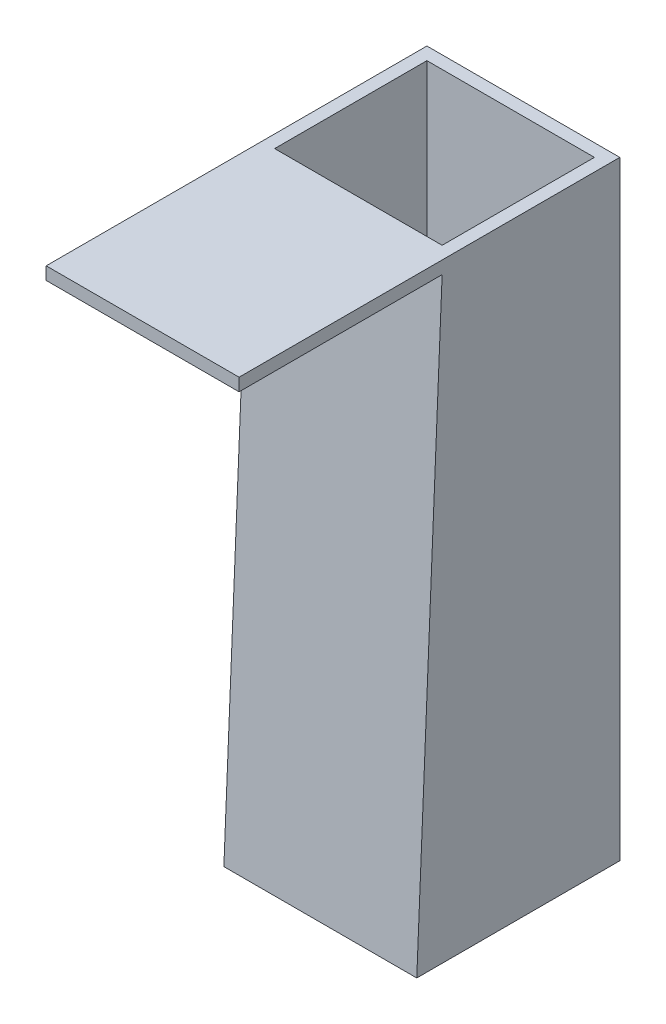
ISO-10303-21;
HEADER;
FILE_DESCRIPTION(('STEP AP214'),'2;1');
FILE_NAME('part.step','',(''),(''),'','','');
FILE_SCHEMA(('AUTOMOTIVE_DESIGN { 1 0 10303 214 1 1 1 1 }'));
ENDSEC;
DATA;
#1=APPLICATION_CONTEXT('core data for automotive mechanical design processes');
#2=APPLICATION_PROTOCOL_DEFINITION('international standard','automotive_design',2000,#1);
#3=PRODUCT_CONTEXT('',#1,'mechanical');
#4=PRODUCT('Part','Part','',(#3));
#5=PRODUCT_RELATED_PRODUCT_CATEGORY('part','',(#4));
#6=PRODUCT_DEFINITION_FORMATION('','',#4);
#7=PRODUCT_DEFINITION_CONTEXT('part definition',#1,'design');
#8=PRODUCT_DEFINITION('design','',#6,#7);
#9=PRODUCT_DEFINITION_SHAPE('','',#8);
#10=(LENGTH_UNIT() NAMED_UNIT(*) SI_UNIT(.MILLI.,.METRE.));
#11=(NAMED_UNIT(*) PLANE_ANGLE_UNIT() SI_UNIT($,.RADIAN.));
#12=(NAMED_UNIT(*) SI_UNIT($,.STERADIAN.) SOLID_ANGLE_UNIT());
#13=UNCERTAINTY_MEASURE_WITH_UNIT(LENGTH_MEASURE(1.E-05),#10,'distance_accuracy_value','');
#14=(GEOMETRIC_REPRESENTATION_CONTEXT(3) GLOBAL_UNCERTAINTY_ASSIGNED_CONTEXT((#13)) GLOBAL_UNIT_ASSIGNED_CONTEXT((#10,
#11,#12)) REPRESENTATION_CONTEXT('',''));
#15=CARTESIAN_POINT('',(0.,0.,0.));
#16=DIRECTION('',(0.,0.,1.));
#17=DIRECTION('',(1.,0.,0.));
#18=AXIS2_PLACEMENT_3D('',#15,#16,#17);
#19=CARTESIAN_POINT('',(96.52,0.,0.));
#20=DIRECTION('',(0.,0.0425147166248136,0.999095840683121));
#21=DIRECTION('',(0.,-0.999095840683121,0.0425147166248136));
#22=AXIS2_PLACEMENT_3D('',#19,#20,#21);
#23=PLANE('',#22);
#24=DIRECTION('',(0.,0.999095840683121,-0.0425147166248136));
#25=VECTOR('',#24,1.);
#26=CARTESIAN_POINT('',(0.,0.,0.));
#27=LINE('',#26,#25);
#28=CARTESIAN_POINT('',(0.,0.,0.));
#29=VERTEX_POINT('',#28);
#30=CARTESIAN_POINT('',(0.,298.45,-12.7));
#31=VERTEX_POINT('',#30);
#32=EDGE_CURVE('E143',#29,#31,#27,.T.);
#33=ORIENTED_EDGE('',*,*,#32,.F.);
#34=DIRECTION('',(-1.,0.,0.));
#35=VECTOR('',#34,1.);
#36=CARTESIAN_POINT('',(96.52,0.,0.));
#37=LINE('',#36,#35);
#38=CARTESIAN_POINT('',(96.52,0.,0.));
#39=VERTEX_POINT('',#38);
#40=EDGE_CURVE('E11',#39,#29,#37,.T.);
#41=ORIENTED_EDGE('',*,*,#40,.F.);
#42=DIRECTION('',(0.,0.999095840683121,-0.0425147166248136));
#43=VECTOR('',#42,1.);
#44=CARTESIAN_POINT('',(96.52,0.,0.));
#45=LINE('',#44,#43);
#46=CARTESIAN_POINT('',(96.52,298.45,-12.7));
#47=VERTEX_POINT('',#46);
#48=EDGE_CURVE('E147',#39,#47,#45,.T.);
#49=ORIENTED_EDGE('',*,*,#48,.T.);
#50=DIRECTION('',(-1.,0.,0.));
#51=VECTOR('',#50,1.);
#52=CARTESIAN_POINT('',(96.52,298.45,-12.7));
#53=LINE('',#52,#51);
#54=EDGE_CURVE('E36',#47,#31,#53,.T.);
#55=ORIENTED_EDGE('',*,*,#54,.T.);
#56=EDGE_LOOP('',(#33,#41,#49,#55));
#57=FACE_BOUND('',#56,.T.);
#58=ADVANCED_FACE('F33',(#57),#23,.T.);
#59=CARTESIAN_POINT('',(96.52,0.,-101.6));
#60=DIRECTION('',(0.,-1.,0.));
#61=DIRECTION('',(0.,0.,-1.));
#62=AXIS2_PLACEMENT_3D('',#59,#60,#61);
#63=PLANE('',#62);
#64=DIRECTION('',(0.,0.,-1.));
#65=VECTOR('',#64,1.);
#66=CARTESIAN_POINT('',(6.35,0.,-95.25));
#67=LINE('',#66,#65);
#68=CARTESIAN_POINT('',(6.35,0.,-19.05));
#69=VERTEX_POINT('',#68);
#70=CARTESIAN_POINT('',(6.34999999999999,0.,-95.25));
#71=VERTEX_POINT('',#70);
#72=EDGE_CURVE('E49',#69,#71,#67,.T.);
#73=ORIENTED_EDGE('',*,*,#72,.F.);
#74=DIRECTION('',(-1.,0.,0.));
#75=VECTOR('',#74,1.);
#76=CARTESIAN_POINT('',(6.35,0.,-19.05));
#77=LINE('',#76,#75);
#78=CARTESIAN_POINT('',(90.17,0.,-19.05));
#79=VERTEX_POINT('',#78);
#80=EDGE_CURVE('E128',#79,#69,#77,.T.);
#81=ORIENTED_EDGE('',*,*,#80,.F.);
#82=DIRECTION('',(0.,0.,1.));
#83=VECTOR('',#82,1.);
#84=CARTESIAN_POINT('',(90.17,0.,-95.25));
#85=LINE('',#84,#83);
#86=CARTESIAN_POINT('',(90.17,0.,-95.25));
#87=VERTEX_POINT('',#86);
#88=EDGE_CURVE('E131',#87,#79,#85,.T.);
#89=ORIENTED_EDGE('',*,*,#88,.F.);
#90=DIRECTION('',(1.,0.,0.));
#91=VECTOR('',#90,1.);
#92=CARTESIAN_POINT('',(6.35,0.,-95.25));
#93=LINE('',#92,#91);
#94=EDGE_CURVE('E137',#71,#87,#93,.T.);
#95=ORIENTED_EDGE('',*,*,#94,.F.);
#96=EDGE_LOOP('',(#73,#81,#89,#95));
#97=FACE_BOUND('',#96,.T.);
#98=DIRECTION('',(0.,0.,1.));
#99=VECTOR('',#98,1.);
#100=CARTESIAN_POINT('',(0.,0.,-101.6));
#101=LINE('',#100,#99);
#102=CARTESIAN_POINT('',(0.,0.,-101.6));
#103=VERTEX_POINT('',#102);
#104=EDGE_CURVE('E151',#103,#29,#101,.T.);
#105=ORIENTED_EDGE('',*,*,#104,.F.);
#106=DIRECTION('',(-1.,0.,0.));
#107=VECTOR('',#106,1.);
#108=CARTESIAN_POINT('',(96.52,0.,-101.6));
#109=LINE('',#108,#107);
#110=CARTESIAN_POINT('',(96.52,0.,-101.6));
#111=VERTEX_POINT('',#110);
#112=EDGE_CURVE('E41',#111,#103,#109,.T.);
#113=ORIENTED_EDGE('',*,*,#112,.F.);
#114=DIRECTION('',(0.,0.,1.));
#115=VECTOR('',#114,1.);
#116=CARTESIAN_POINT('',(96.52,0.,-101.6));
#117=LINE('',#116,#115);
#118=EDGE_CURVE('E163',#111,#39,#117,.T.);
#119=ORIENTED_EDGE('',*,*,#118,.T.);
#120=ORIENTED_EDGE('',*,*,#40,.T.);
#121=EDGE_LOOP('',(#105,#113,#119,#120));
#122=FACE_BOUND('',#121,.T.);
#123=ADVANCED_FACE('F200',(#97,#122),#63,.T.);
#124=CARTESIAN_POINT('',(96.52,304.8,-101.6));
#125=DIRECTION('',(0.,0.,-1.));
#126=DIRECTION('',(0.,1.,0.));
#127=AXIS2_PLACEMENT_3D('',#124,#125,#126);
#128=PLANE('',#127);
#129=DIRECTION('',(0.,-1.,0.));
#130=VECTOR('',#129,1.);
#131=CARTESIAN_POINT('',(0.,304.8,-101.6));
#132=LINE('',#131,#130);
#133=CARTESIAN_POINT('',(0.,304.8,-101.6));
#134=VERTEX_POINT('',#133);
#135=EDGE_CURVE('E177',#134,#103,#132,.T.);
#136=ORIENTED_EDGE('',*,*,#135,.F.);
#137=DIRECTION('',(-1.,0.,0.));
#138=VECTOR('',#137,1.);
#139=CARTESIAN_POINT('',(96.52,304.8,-101.6));
#140=LINE('',#139,#138);
#141=CARTESIAN_POINT('',(96.52,304.8,-101.6));
#142=VERTEX_POINT('',#141);
#143=EDGE_CURVE('E183',#142,#134,#140,.T.);
#144=ORIENTED_EDGE('',*,*,#143,.F.);
#145=DIRECTION('',(0.,-1.,0.));
#146=VECTOR('',#145,1.);
#147=CARTESIAN_POINT('',(96.52,304.8,-101.6));
#148=LINE('',#147,#146);
#149=EDGE_CURVE('E160',#142,#111,#148,.T.);
#150=ORIENTED_EDGE('',*,*,#149,.T.);
#151=ORIENTED_EDGE('',*,*,#112,.T.);
#152=EDGE_LOOP('',(#136,#144,#150,#151));
#153=FACE_BOUND('',#152,.T.);
#154=ADVANCED_FACE('F211',(#153),#128,.T.);
#155=CARTESIAN_POINT('',(96.52,304.8,88.9));
#156=DIRECTION('',(0.,1.,0.));
#157=DIRECTION('',(0.,0.,1.));
#158=AXIS2_PLACEMENT_3D('',#155,#156,#157);
#159=PLANE('',#158);
#160=DIRECTION('',(0.,0.,-1.));
#161=VECTOR('',#160,1.);
#162=CARTESIAN_POINT('',(6.35,304.8,-95.25));
#163=LINE('',#162,#161);
#164=CARTESIAN_POINT('',(6.35,304.8,-19.05));
#165=VERTEX_POINT('',#164);
#166=CARTESIAN_POINT('',(6.35,304.8,-95.25));
#167=VERTEX_POINT('',#166);
#168=EDGE_CURVE('E112',#165,#167,#163,.T.);
#169=ORIENTED_EDGE('',*,*,#168,.T.);
#170=DIRECTION('',(1.,0.,0.));
#171=VECTOR('',#170,1.);
#172=CARTESIAN_POINT('',(6.35,304.8,-95.25));
#173=LINE('',#172,#171);
#174=CARTESIAN_POINT('',(90.17,304.8,-95.25));
#175=VERTEX_POINT('',#174);
#176=EDGE_CURVE('E121',#167,#175,#173,.T.);
#177=ORIENTED_EDGE('',*,*,#176,.T.);
#178=DIRECTION('',(0.,0.,1.));
#179=VECTOR('',#178,1.);
#180=CARTESIAN_POINT('',(90.17,304.8,-95.25));
#181=LINE('',#180,#179);
#182=CARTESIAN_POINT('',(90.17,304.8,-19.05));
#183=VERTEX_POINT('',#182);
#184=EDGE_CURVE('E57',#175,#183,#181,.T.);
#185=ORIENTED_EDGE('',*,*,#184,.T.);
#186=DIRECTION('',(-1.,0.,0.));
#187=VECTOR('',#186,1.);
#188=CARTESIAN_POINT('',(6.35,304.8,-19.05));
#189=LINE('',#188,#187);
#190=EDGE_CURVE('E118',#183,#165,#189,.T.);
#191=ORIENTED_EDGE('',*,*,#190,.T.);
#192=EDGE_LOOP('',(#169,#177,#185,#191));
#193=FACE_BOUND('',#192,.T.);
#194=DIRECTION('',(0.,0.,-1.));
#195=VECTOR('',#194,1.);
#196=CARTESIAN_POINT('',(0.,304.8,88.9));
#197=LINE('',#196,#195);
#198=CARTESIAN_POINT('',(0.,304.8,88.9));
#199=VERTEX_POINT('',#198);
#200=EDGE_CURVE('E174',#199,#134,#197,.T.);
#201=ORIENTED_EDGE('',*,*,#200,.F.);
#202=DIRECTION('',(-1.,0.,0.));
#203=VECTOR('',#202,1.);
#204=CARTESIAN_POINT('',(96.52,304.8,88.9));
#205=LINE('',#204,#203);
#206=CARTESIAN_POINT('',(96.52,304.8,88.9));
#207=VERTEX_POINT('',#206);
#208=EDGE_CURVE('E185',#207,#199,#205,.T.);
#209=ORIENTED_EDGE('',*,*,#208,.F.);
#210=DIRECTION('',(0.,0.,-1.));
#211=VECTOR('',#210,1.);
#212=CARTESIAN_POINT('',(96.52,304.8,88.9));
#213=LINE('',#212,#211);
#214=EDGE_CURVE('E157',#207,#142,#213,.T.);
#215=ORIENTED_EDGE('',*,*,#214,.T.);
#216=ORIENTED_EDGE('',*,*,#143,.T.);
#217=EDGE_LOOP('',(#201,#209,#215,#216));
#218=FACE_BOUND('',#217,.T.);
#219=ADVANCED_FACE('F125',(#193,#218),#159,.T.);
#220=CARTESIAN_POINT('',(96.52,298.45,88.9));
#221=DIRECTION('',(0.,0.,1.));
#222=DIRECTION('',(0.,-1.,0.));
#223=AXIS2_PLACEMENT_3D('',#220,#221,#222);
#224=PLANE('',#223);
#225=DIRECTION('',(0.,1.,0.));
#226=VECTOR('',#225,1.);
#227=CARTESIAN_POINT('',(0.,298.45,88.9));
#228=LINE('',#227,#226);
#229=CARTESIAN_POINT('',(0.,298.45,88.9));
#230=VERTEX_POINT('',#229);
#231=EDGE_CURVE('E171',#230,#199,#228,.T.);
#232=ORIENTED_EDGE('',*,*,#231,.F.);
#233=DIRECTION('',(-1.,0.,0.));
#234=VECTOR('',#233,1.);
#235=CARTESIAN_POINT('',(96.52,298.45,88.9));
#236=LINE('',#235,#234);
#237=CARTESIAN_POINT('',(96.52,298.45,88.9));
#238=VERTEX_POINT('',#237);
#239=EDGE_CURVE('E186',#238,#230,#236,.T.);
#240=ORIENTED_EDGE('',*,*,#239,.F.);
#241=DIRECTION('',(0.,1.,0.));
#242=VECTOR('',#241,1.);
#243=CARTESIAN_POINT('',(96.52,298.45,88.9));
#244=LINE('',#243,#242);
#245=EDGE_CURVE('E154',#238,#207,#244,.T.);
#246=ORIENTED_EDGE('',*,*,#245,.T.);
#247=ORIENTED_EDGE('',*,*,#208,.T.);
#248=EDGE_LOOP('',(#232,#240,#246,#247));
#249=FACE_BOUND('',#248,.T.);
#250=ADVANCED_FACE('F208',(#249),#224,.T.);
#251=CARTESIAN_POINT('',(96.52,298.45,-12.7));
#252=DIRECTION('',(0.,-1.,0.));
#253=DIRECTION('',(0.,0.,-1.));
#254=AXIS2_PLACEMENT_3D('',#251,#252,#253);
#255=PLANE('',#254);
#256=DIRECTION('',(0.,0.,1.));
#257=VECTOR('',#256,1.);
#258=CARTESIAN_POINT('',(0.,298.45,-12.7));
#259=LINE('',#258,#257);
#260=EDGE_CURVE('E168',#31,#230,#259,.T.);
#261=ORIENTED_EDGE('',*,*,#260,.F.);
#262=ORIENTED_EDGE('',*,*,#54,.F.);
#263=DIRECTION('',(0.,0.,1.));
#264=VECTOR('',#263,1.);
#265=CARTESIAN_POINT('',(96.52,298.45,-12.7));
#266=LINE('',#265,#264);
#267=EDGE_CURVE('E150',#47,#238,#266,.T.);
#268=ORIENTED_EDGE('',*,*,#267,.T.);
#269=ORIENTED_EDGE('',*,*,#239,.T.);
#270=EDGE_LOOP('',(#261,#262,#268,#269));
#271=FACE_BOUND('',#270,.T.);
#272=ADVANCED_FACE('F194',(#271),#255,.T.);
#273=CARTESIAN_POINT('',(96.52,0.,0.));
#274=DIRECTION('',(1.,0.,0.));
#275=DIRECTION('',(0.,0.,-1.));
#276=AXIS2_PLACEMENT_3D('',#273,#274,#275);
#277=PLANE('',#276);
#278=ORIENTED_EDGE('',*,*,#48,.F.);
#279=ORIENTED_EDGE('',*,*,#118,.F.);
#280=ORIENTED_EDGE('',*,*,#149,.F.);
#281=ORIENTED_EDGE('',*,*,#214,.F.);
#282=ORIENTED_EDGE('',*,*,#245,.F.);
#283=ORIENTED_EDGE('',*,*,#267,.F.);
#284=EDGE_LOOP('',(#278,#279,#280,#281,#282,#283));
#285=FACE_BOUND('',#284,.T.);
#286=ADVANCED_FACE('F203',(#285),#277,.T.);
#287=CARTESIAN_POINT('',(0.,0.,0.));
#288=DIRECTION('',(1.,0.,0.));
#289=DIRECTION('',(0.,0.,-1.));
#290=AXIS2_PLACEMENT_3D('',#287,#288,#289);
#291=PLANE('',#290);
#292=ORIENTED_EDGE('',*,*,#32,.T.);
#293=ORIENTED_EDGE('',*,*,#260,.T.);
#294=ORIENTED_EDGE('',*,*,#231,.T.);
#295=ORIENTED_EDGE('',*,*,#200,.T.);
#296=ORIENTED_EDGE('',*,*,#135,.T.);
#297=ORIENTED_EDGE('',*,*,#104,.T.);
#298=EDGE_LOOP('',(#292,#293,#294,#295,#296,#297));
#299=FACE_BOUND('',#298,.T.);
#300=ADVANCED_FACE('F196',(#299),#291,.F.);
#301=CARTESIAN_POINT('',(6.35,304.8,-95.25));
#302=DIRECTION('',(-1.,0.,0.));
#303=DIRECTION('',(0.,0.,1.));
#304=AXIS2_PLACEMENT_3D('',#301,#302,#303);
#305=PLANE('',#304);
#306=ORIENTED_EDGE('',*,*,#72,.T.);
#307=DIRECTION('',(0.,-1.,0.));
#308=VECTOR('',#307,1.);
#309=CARTESIAN_POINT('',(6.35,304.8,-95.25));
#310=LINE('',#309,#308);
#311=EDGE_CURVE('E108',#167,#71,#310,.T.);
#312=ORIENTED_EDGE('',*,*,#311,.F.);
#313=ORIENTED_EDGE('',*,*,#168,.F.);
#314=DIRECTION('',(0.,-1.,0.));
#315=VECTOR('',#314,1.);
#316=CARTESIAN_POINT('',(6.35,304.8,-19.05));
#317=LINE('',#316,#315);
#318=EDGE_CURVE('E141',#165,#69,#317,.T.);
#319=ORIENTED_EDGE('',*,*,#318,.T.);
#320=EDGE_LOOP('',(#306,#312,#313,#319));
#321=FACE_BOUND('',#320,.T.);
#322=ADVANCED_FACE('F110',(#321),#305,.F.);
#323=CARTESIAN_POINT('',(6.35,304.8,-19.05));
#324=DIRECTION('',(0.,0.,1.));
#325=DIRECTION('',(0.,-1.,0.));
#326=AXIS2_PLACEMENT_3D('',#323,#324,#325);
#327=PLANE('',#326);
#328=ORIENTED_EDGE('',*,*,#80,.T.);
#329=ORIENTED_EDGE('',*,*,#318,.F.);
#330=ORIENTED_EDGE('',*,*,#190,.F.);
#331=DIRECTION('',(0.,-1.,0.));
#332=VECTOR('',#331,1.);
#333=CARTESIAN_POINT('',(90.17,304.8,-19.05));
#334=LINE('',#333,#332);
#335=EDGE_CURVE('E144',#183,#79,#334,.T.);
#336=ORIENTED_EDGE('',*,*,#335,.T.);
#337=EDGE_LOOP('',(#328,#329,#330,#336));
#338=FACE_BOUND('',#337,.T.);
#339=ADVANCED_FACE('F251',(#338),#327,.F.);
#340=CARTESIAN_POINT('',(90.17,304.8,-95.25));
#341=DIRECTION('',(1.,0.,0.));
#342=DIRECTION('',(0.,0.,-1.));
#343=AXIS2_PLACEMENT_3D('',#340,#341,#342);
#344=PLANE('',#343);
#345=ORIENTED_EDGE('',*,*,#88,.T.);
#346=ORIENTED_EDGE('',*,*,#335,.F.);
#347=ORIENTED_EDGE('',*,*,#184,.F.);
#348=DIRECTION('',(0.,-1.,0.));
#349=VECTOR('',#348,1.);
#350=CARTESIAN_POINT('',(90.17,304.8,-95.25));
#351=LINE('',#350,#349);
#352=EDGE_CURVE('E117',#175,#87,#351,.T.);
#353=ORIENTED_EDGE('',*,*,#352,.T.);
#354=EDGE_LOOP('',(#345,#346,#347,#353));
#355=FACE_BOUND('',#354,.T.);
#356=ADVANCED_FACE('F260',(#355),#344,.F.);
#357=CARTESIAN_POINT('',(6.35,304.8,-95.25));
#358=DIRECTION('',(0.,0.,-1.));
#359=DIRECTION('',(0.,1.,0.));
#360=AXIS2_PLACEMENT_3D('',#357,#358,#359);
#361=PLANE('',#360);
#362=ORIENTED_EDGE('',*,*,#94,.T.);
#363=ORIENTED_EDGE('',*,*,#352,.F.);
#364=ORIENTED_EDGE('',*,*,#176,.F.);
#365=ORIENTED_EDGE('',*,*,#311,.T.);
#366=EDGE_LOOP('',(#362,#363,#364,#365));
#367=FACE_BOUND('',#366,.T.);
#368=ADVANCED_FACE('F122',(#367),#361,.F.);
#369=CLOSED_SHELL('',(#58,#123,#154,#219,#250,#272,#286,#300,#322,#339,#356,#368));
#370=MANIFOLD_SOLID_BREP('B2',#369);
#371=ADVANCED_BREP_SHAPE_REPRESENTATION('',(#18,#370),#14);
#372=SHAPE_DEFINITION_REPRESENTATION(#9,#371);
ENDSEC;
END-ISO-10303-21;
